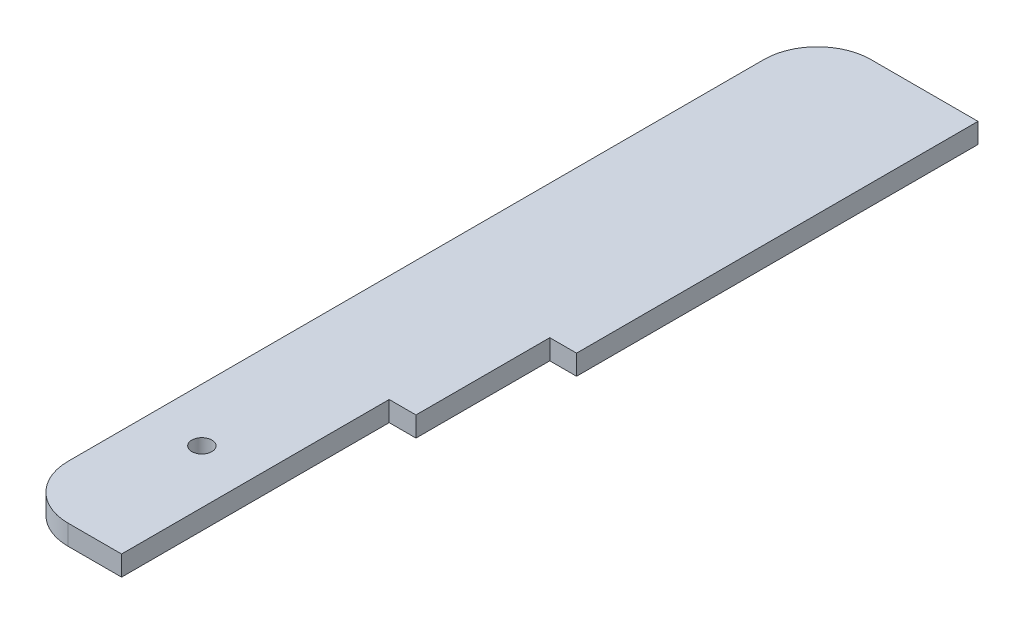
ISO-10303-21;
HEADER;
FILE_DESCRIPTION(('STEP AP214'),'2;1');
FILE_NAME('part.step','',(''),(''),'','','');
FILE_SCHEMA(('AUTOMOTIVE_DESIGN { 1 0 10303 214 1 1 1 1 }'));
ENDSEC;
DATA;
#1=APPLICATION_CONTEXT('core data for automotive mechanical design processes');
#2=APPLICATION_PROTOCOL_DEFINITION('international standard','automotive_design',2000,#1);
#3=PRODUCT_CONTEXT('',#1,'mechanical');
#4=PRODUCT('Part','Part','',(#3));
#5=PRODUCT_RELATED_PRODUCT_CATEGORY('part','',(#4));
#6=PRODUCT_DEFINITION_FORMATION('','',#4);
#7=PRODUCT_DEFINITION_CONTEXT('part definition',#1,'design');
#8=PRODUCT_DEFINITION('design','',#6,#7);
#9=PRODUCT_DEFINITION_SHAPE('','',#8);
#10=(LENGTH_UNIT() NAMED_UNIT(*) SI_UNIT(.MILLI.,.METRE.));
#11=(NAMED_UNIT(*) PLANE_ANGLE_UNIT() SI_UNIT($,.RADIAN.));
#12=(NAMED_UNIT(*) SI_UNIT($,.STERADIAN.) SOLID_ANGLE_UNIT());
#13=UNCERTAINTY_MEASURE_WITH_UNIT(LENGTH_MEASURE(1.E-05),#10,'distance_accuracy_value','');
#14=(GEOMETRIC_REPRESENTATION_CONTEXT(3) GLOBAL_UNCERTAINTY_ASSIGNED_CONTEXT((#13)) GLOBAL_UNIT_ASSIGNED_CONTEXT((#10,
#11,#12)) REPRESENTATION_CONTEXT('',''));
#15=CARTESIAN_POINT('',(0.,0.,0.));
#16=DIRECTION('',(0.,0.,1.));
#17=DIRECTION('',(1.,0.,0.));
#18=AXIS2_PLACEMENT_3D('',#15,#16,#17);
#19=CARTESIAN_POINT('',(0.,4.7625,0.));
#20=DIRECTION('',(-1.,0.,0.));
#21=DIRECTION('',(0.,0.,1.));
#22=AXIS2_PLACEMENT_3D('',#19,#20,#21);
#23=PLANE('',#22);
#24=DIRECTION('',(0.,0.,-1.));
#25=VECTOR('',#24,1.);
#26=CARTESIAN_POINT('',(0.,-4.7625,0.));
#27=LINE('',#26,#25);
#28=CARTESIAN_POINT('',(0.,-4.7625,0.));
#29=VERTEX_POINT('',#28);
#30=CARTESIAN_POINT('',(0.,-4.7625,-127.));
#31=VERTEX_POINT('',#30);
#32=EDGE_CURVE('E134',#29,#31,#27,.T.);
#33=ORIENTED_EDGE('',*,*,#32,.T.);
#34=DIRECTION('',(0.,-1.,0.));
#35=VECTOR('',#34,1.);
#36=CARTESIAN_POINT('',(0.,4.7625,-127.));
#37=LINE('',#36,#35);
#38=CARTESIAN_POINT('',(0.,4.7625,-127.));
#39=VERTEX_POINT('',#38);
#40=EDGE_CURVE('E117',#39,#31,#37,.T.);
#41=ORIENTED_EDGE('',*,*,#40,.F.);
#42=DIRECTION('',(0.,0.,-1.));
#43=VECTOR('',#42,1.);
#44=CARTESIAN_POINT('',(0.,4.7625,0.));
#45=LINE('',#44,#43);
#46=CARTESIAN_POINT('',(0.,4.7625,0.));
#47=VERTEX_POINT('',#46);
#48=EDGE_CURVE('E123',#47,#39,#45,.T.);
#49=ORIENTED_EDGE('',*,*,#48,.F.);
#50=DIRECTION('',(0.,-1.,0.));
#51=VECTOR('',#50,1.);
#52=CARTESIAN_POINT('',(0.,4.7625,0.));
#53=LINE('',#52,#51);
#54=EDGE_CURVE('E181',#47,#29,#53,.T.);
#55=ORIENTED_EDGE('',*,*,#54,.T.);
#56=EDGE_LOOP('',(#33,#41,#49,#55));
#57=FACE_BOUND('',#56,.T.);
#58=ADVANCED_FACE('F33',(#57),#23,.F.);
#59=CARTESIAN_POINT('',(0.,4.7625,-127.));
#60=DIRECTION('',(0.,0.,-1.));
#61=DIRECTION('',(-1.,0.,0.));
#62=AXIS2_PLACEMENT_3D('',#59,#60,#61);
#63=PLANE('',#62);
#64=DIRECTION('',(1.,0.,0.));
#65=VECTOR('',#64,1.);
#66=CARTESIAN_POINT('',(0.,-4.7625,-127.));
#67=LINE('',#66,#65);
#68=CARTESIAN_POINT('',(12.7,-4.7625,-127.));
#69=VERTEX_POINT('',#68);
#70=EDGE_CURVE('E197',#31,#69,#67,.T.);
#71=ORIENTED_EDGE('',*,*,#70,.T.);
#72=DIRECTION('',(0.,-1.,0.));
#73=VECTOR('',#72,1.);
#74=CARTESIAN_POINT('',(12.7,4.7625,-127.));
#75=LINE('',#74,#73);
#76=CARTESIAN_POINT('',(12.7,4.7625,-127.));
#77=VERTEX_POINT('',#76);
#78=EDGE_CURVE('E120',#77,#69,#75,.T.);
#79=ORIENTED_EDGE('',*,*,#78,.F.);
#80=DIRECTION('',(1.,0.,0.));
#81=VECTOR('',#80,1.);
#82=CARTESIAN_POINT('',(0.,4.7625,-127.));
#83=LINE('',#82,#81);
#84=EDGE_CURVE('E113',#39,#77,#83,.T.);
#85=ORIENTED_EDGE('',*,*,#84,.F.);
#86=ORIENTED_EDGE('',*,*,#40,.T.);
#87=EDGE_LOOP('',(#71,#79,#85,#86));
#88=FACE_BOUND('',#87,.T.);
#89=ADVANCED_FACE('F115',(#88),#63,.F.);
#90=CARTESIAN_POINT('',(12.7,4.7625,-127.));
#91=DIRECTION('',(-1.,0.,0.));
#92=DIRECTION('',(0.,0.,1.));
#93=AXIS2_PLACEMENT_3D('',#90,#91,#92);
#94=PLANE('',#93);
#95=DIRECTION('',(0.,0.,-1.));
#96=VECTOR('',#95,1.);
#97=CARTESIAN_POINT('',(12.7,-4.7625,-127.));
#98=LINE('',#97,#96);
#99=CARTESIAN_POINT('',(12.7,-4.7625,-190.5));
#100=VERTEX_POINT('',#99);
#101=EDGE_CURVE('E196',#69,#100,#98,.T.);
#102=ORIENTED_EDGE('',*,*,#101,.T.);
#103=DIRECTION('',(0.,-1.,0.));
#104=VECTOR('',#103,1.);
#105=CARTESIAN_POINT('',(12.7,4.7625,-190.5));
#106=LINE('',#105,#104);
#107=CARTESIAN_POINT('',(12.7,4.7625,-190.5));
#108=VERTEX_POINT('',#107);
#109=EDGE_CURVE('E139',#108,#100,#106,.T.);
#110=ORIENTED_EDGE('',*,*,#109,.F.);
#111=DIRECTION('',(0.,0.,-1.));
#112=VECTOR('',#111,1.);
#113=CARTESIAN_POINT('',(12.7,4.7625,-127.));
#114=LINE('',#113,#112);
#115=EDGE_CURVE('E122',#77,#108,#114,.T.);
#116=ORIENTED_EDGE('',*,*,#115,.F.);
#117=ORIENTED_EDGE('',*,*,#78,.T.);
#118=EDGE_LOOP('',(#102,#110,#116,#117));
#119=FACE_BOUND('',#118,.T.);
#120=ADVANCED_FACE('F235',(#119),#94,.F.);
#121=CARTESIAN_POINT('',(12.7,4.7625,-190.5));
#122=DIRECTION('',(0.,0.,-1.));
#123=DIRECTION('',(-1.,0.,0.));
#124=AXIS2_PLACEMENT_3D('',#121,#122,#123);
#125=PLANE('',#124);
#126=DIRECTION('',(1.,0.,0.));
#127=VECTOR('',#126,1.);
#128=CARTESIAN_POINT('',(12.7,-4.7625,-190.5));
#129=LINE('',#128,#127);
#130=CARTESIAN_POINT('',(25.4,-4.7625,-190.5));
#131=VERTEX_POINT('',#130);
#132=EDGE_CURVE('E176',#100,#131,#129,.T.);
#133=ORIENTED_EDGE('',*,*,#132,.T.);
#134=DIRECTION('',(0.,-1.,0.));
#135=VECTOR('',#134,1.);
#136=CARTESIAN_POINT('',(25.4,4.7625,-190.5));
#137=LINE('',#136,#135);
#138=CARTESIAN_POINT('',(25.4,4.7625,-190.5));
#139=VERTEX_POINT('',#138);
#140=EDGE_CURVE('E184',#139,#131,#137,.T.);
#141=ORIENTED_EDGE('',*,*,#140,.F.);
#142=DIRECTION('',(1.,0.,0.));
#143=VECTOR('',#142,1.);
#144=CARTESIAN_POINT('',(12.7,4.7625,-190.5));
#145=LINE('',#144,#143);
#146=EDGE_CURVE('E193',#108,#139,#145,.T.);
#147=ORIENTED_EDGE('',*,*,#146,.F.);
#148=ORIENTED_EDGE('',*,*,#109,.T.);
#149=EDGE_LOOP('',(#133,#141,#147,#148));
#150=FACE_BOUND('',#149,.T.);
#151=ADVANCED_FACE('F191',(#150),#125,.F.);
#152=CARTESIAN_POINT('',(25.4,4.7625,-190.5));
#153=DIRECTION('',(-1.,0.,0.));
#154=DIRECTION('',(0.,0.,1.));
#155=AXIS2_PLACEMENT_3D('',#152,#153,#154);
#156=PLANE('',#155);
#157=DIRECTION('',(0.,0.,-1.));
#158=VECTOR('',#157,1.);
#159=CARTESIAN_POINT('',(25.4,-4.7625,-190.5));
#160=LINE('',#159,#158);
#161=CARTESIAN_POINT('',(25.4,-4.7625,-381.));
#162=VERTEX_POINT('',#161);
#163=EDGE_CURVE('E173',#131,#162,#160,.T.);
#164=ORIENTED_EDGE('',*,*,#163,.T.);
#165=DIRECTION('',(0.,-1.,0.));
#166=VECTOR('',#165,1.);
#167=CARTESIAN_POINT('',(25.4,4.7625,-381.));
#168=LINE('',#167,#166);
#169=CARTESIAN_POINT('',(25.4,4.7625,-381.));
#170=VERTEX_POINT('',#169);
#171=EDGE_CURVE('E172',#170,#162,#168,.T.);
#172=ORIENTED_EDGE('',*,*,#171,.F.);
#173=DIRECTION('',(0.,0.,-1.));
#174=VECTOR('',#173,1.);
#175=CARTESIAN_POINT('',(25.4,4.7625,-190.5));
#176=LINE('',#175,#174);
#177=EDGE_CURVE('E205',#139,#170,#176,.T.);
#178=ORIENTED_EDGE('',*,*,#177,.F.);
#179=ORIENTED_EDGE('',*,*,#140,.T.);
#180=EDGE_LOOP('',(#164,#172,#178,#179));
#181=FACE_BOUND('',#180,.T.);
#182=ADVANCED_FACE('F251',(#181),#156,.F.);
#183=CARTESIAN_POINT('',(25.4,4.7625,-381.));
#184=DIRECTION('',(0.,0.,1.));
#185=DIRECTION('',(1.,0.,0.));
#186=AXIS2_PLACEMENT_3D('',#183,#184,#185);
#187=PLANE('',#186);
#188=DIRECTION('',(-1.,0.,0.));
#189=VECTOR('',#188,1.);
#190=CARTESIAN_POINT('',(25.4,-4.7625,-381.));
#191=LINE('',#190,#189);
#192=CARTESIAN_POINT('',(-25.4000000000001,-4.7625,-381.));
#193=VERTEX_POINT('',#192);
#194=EDGE_CURVE('E167',#162,#193,#191,.T.);
#195=ORIENTED_EDGE('',*,*,#194,.T.);
#196=DIRECTION('',(0.,-1.,0.));
#197=VECTOR('',#196,1.);
#198=CARTESIAN_POINT('',(-25.4000000000001,4.7625,-381.));
#199=LINE('',#198,#197);
#200=CARTESIAN_POINT('',(-25.4000000000001,4.7625,-381.));
#201=VERTEX_POINT('',#200);
#202=EDGE_CURVE('E56',#193,#201,#199,.F.);
#203=ORIENTED_EDGE('',*,*,#202,.T.);
#204=DIRECTION('',(-1.,0.,0.));
#205=VECTOR('',#204,1.);
#206=CARTESIAN_POINT('',(25.4,4.7625,-381.));
#207=LINE('',#206,#205);
#208=EDGE_CURVE('E153',#170,#201,#207,.T.);
#209=ORIENTED_EDGE('',*,*,#208,.F.);
#210=ORIENTED_EDGE('',*,*,#171,.T.);
#211=EDGE_LOOP('',(#195,#203,#209,#210));
#212=FACE_BOUND('',#211,.T.);
#213=ADVANCED_FACE('F170',(#212),#187,.F.);
#214=CARTESIAN_POINT('',(-50.8000000000001,4.7625,-381.));
#215=DIRECTION('',(1.,0.,0.));
#216=DIRECTION('',(0.,0.,-1.));
#217=AXIS2_PLACEMENT_3D('',#214,#215,#216);
#218=PLANE('',#217);
#219=DIRECTION('',(0.,0.,1.));
#220=VECTOR('',#219,1.);
#221=CARTESIAN_POINT('',(-50.8000000000001,4.7625,-381.));
#222=LINE('',#221,#220);
#223=CARTESIAN_POINT('',(-50.8,4.7625,-355.6));
#224=VERTEX_POINT('',#223);
#225=CARTESIAN_POINT('',(-50.8,4.7625,-25.4));
#226=VERTEX_POINT('',#225);
#227=EDGE_CURVE('E152',#224,#226,#222,.T.);
#228=ORIENTED_EDGE('',*,*,#227,.F.);
#229=DIRECTION('',(0.,-1.,0.));
#230=VECTOR('',#229,1.);
#231=CARTESIAN_POINT('',(-50.8,4.7625,-355.6));
#232=LINE('',#231,#230);
#233=CARTESIAN_POINT('',(-50.8,-4.7625,-355.6));
#234=VERTEX_POINT('',#233);
#235=EDGE_CURVE('E137',#224,#234,#232,.T.);
#236=ORIENTED_EDGE('',*,*,#235,.T.);
#237=DIRECTION('',(0.,0.,1.));
#238=VECTOR('',#237,1.);
#239=CARTESIAN_POINT('',(-50.8000000000001,-4.7625,-381.));
#240=LINE('',#239,#238);
#241=CARTESIAN_POINT('',(-50.8,-4.7625,-25.4));
#242=VERTEX_POINT('',#241);
#243=EDGE_CURVE('E168',#234,#242,#240,.T.);
#244=ORIENTED_EDGE('',*,*,#243,.T.);
#245=DIRECTION('',(0.,-1.,0.));
#246=VECTOR('',#245,1.);
#247=CARTESIAN_POINT('',(-50.8,4.7625,-25.4));
#248=LINE('',#247,#246);
#249=EDGE_CURVE('E135',#242,#226,#248,.F.);
#250=ORIENTED_EDGE('',*,*,#249,.T.);
#251=EDGE_LOOP('',(#228,#236,#244,#250));
#252=FACE_BOUND('',#251,.T.);
#253=ADVANCED_FACE('F157',(#252),#218,.F.);
#254=CARTESIAN_POINT('',(0.,4.7625,0.));
#255=DIRECTION('',(0.,0.,-1.));
#256=DIRECTION('',(-1.,0.,0.));
#257=AXIS2_PLACEMENT_3D('',#254,#255,#256);
#258=PLANE('',#257);
#259=DIRECTION('',(1.,0.,0.));
#260=VECTOR('',#259,1.);
#261=CARTESIAN_POINT('',(0.,4.7625,0.));
#262=LINE('',#261,#260);
#263=CARTESIAN_POINT('',(-25.4,4.7625,0.));
#264=VERTEX_POINT('',#263);
#265=EDGE_CURVE('E127',#264,#47,#262,.T.);
#266=ORIENTED_EDGE('',*,*,#265,.F.);
#267=DIRECTION('',(0.,-1.,0.));
#268=VECTOR('',#267,1.);
#269=CARTESIAN_POINT('',(-25.4,4.7625,0.));
#270=LINE('',#269,#268);
#271=CARTESIAN_POINT('',(-25.4,-4.7625,0.));
#272=VERTEX_POINT('',#271);
#273=EDGE_CURVE('E11',#264,#272,#270,.T.);
#274=ORIENTED_EDGE('',*,*,#273,.T.);
#275=DIRECTION('',(1.,0.,0.));
#276=VECTOR('',#275,1.);
#277=CARTESIAN_POINT('',(0.,-4.7625,0.));
#278=LINE('',#277,#276);
#279=EDGE_CURVE('E131',#272,#29,#278,.T.);
#280=ORIENTED_EDGE('',*,*,#279,.T.);
#281=ORIENTED_EDGE('',*,*,#54,.F.);
#282=EDGE_LOOP('',(#266,#274,#280,#281));
#283=FACE_BOUND('',#282,.T.);
#284=ADVANCED_FACE('F218',(#283),#258,.F.);
#285=CARTESIAN_POINT('',(0.,4.7625,0.));
#286=DIRECTION('',(0.,-1.,0.));
#287=DIRECTION('',(0.,0.,-1.));
#288=AXIS2_PLACEMENT_3D('',#285,#286,#287);
#289=PLANE('',#288);
#290=CARTESIAN_POINT('',(-25.4,4.7625,-63.5));
#291=DIRECTION('',(0.,1.,0.));
#292=DIRECTION('',(0.,0.,1.));
#293=AXIS2_PLACEMENT_3D('',#290,#291,#292);
#294=CIRCLE('',#293,4.76249999999999);
#295=CARTESIAN_POINT('',(-25.4,4.7625,-58.7375));
#296=VERTEX_POINT('',#295);
#297=EDGE_CURVE('E211',#296,#296,#294,.T.);
#298=ORIENTED_EDGE('',*,*,#297,.F.);
#299=EDGE_LOOP('',(#298));
#300=FACE_BOUND('',#299,.T.);
#301=ORIENTED_EDGE('',*,*,#208,.T.);
#302=CARTESIAN_POINT('',(-25.4000000000001,4.7625,-355.6));
#303=DIRECTION('',(0.,-1.,0.));
#304=DIRECTION('',(0.,0.,-1.));
#305=AXIS2_PLACEMENT_3D('',#302,#303,#304);
#306=CIRCLE('',#305,25.4);
#307=EDGE_CURVE('E41',#201,#224,#306,.F.);
#308=ORIENTED_EDGE('',*,*,#307,.T.);
#309=ORIENTED_EDGE('',*,*,#227,.T.);
#310=CARTESIAN_POINT('',(-25.4,4.7625,-25.4));
#311=DIRECTION('',(0.,-1.,0.));
#312=DIRECTION('',(0.,0.,-1.));
#313=AXIS2_PLACEMENT_3D('',#310,#311,#312);
#314=CIRCLE('',#313,25.4);
#315=EDGE_CURVE('E48',#226,#264,#314,.F.);
#316=ORIENTED_EDGE('',*,*,#315,.T.);
#317=ORIENTED_EDGE('',*,*,#265,.T.);
#318=ORIENTED_EDGE('',*,*,#48,.T.);
#319=ORIENTED_EDGE('',*,*,#84,.T.);
#320=ORIENTED_EDGE('',*,*,#115,.T.);
#321=ORIENTED_EDGE('',*,*,#146,.T.);
#322=ORIENTED_EDGE('',*,*,#177,.T.);
#323=EDGE_LOOP('',(#301,#308,#309,#316,#317,#318,#319,#320,#321,#322));
#324=FACE_BOUND('',#323,.T.);
#325=ADVANCED_FACE('F126',(#300,#324),#289,.F.);
#326=CARTESIAN_POINT('',(0.,-4.7625,0.));
#327=DIRECTION('',(0.,-1.,0.));
#328=DIRECTION('',(0.,0.,-1.));
#329=AXIS2_PLACEMENT_3D('',#326,#327,#328);
#330=PLANE('',#329);
#331=CARTESIAN_POINT('',(-25.4,-4.7625,-63.5));
#332=DIRECTION('',(0.,-1.,0.));
#333=DIRECTION('',(0.,0.,-1.));
#334=AXIS2_PLACEMENT_3D('',#331,#332,#333);
#335=CIRCLE('',#334,4.76249999999999);
#336=CARTESIAN_POINT('',(-25.4,-4.7625,-68.2625));
#337=VERTEX_POINT('',#336);
#338=EDGE_CURVE('E202',#337,#337,#335,.T.);
#339=ORIENTED_EDGE('',*,*,#338,.F.);
#340=EDGE_LOOP('',(#339));
#341=FACE_BOUND('',#340,.T.);
#342=ORIENTED_EDGE('',*,*,#243,.F.);
#343=CARTESIAN_POINT('',(-25.4000000000001,-4.7625,-355.6));
#344=DIRECTION('',(0.,-1.,0.));
#345=DIRECTION('',(0.,0.,-1.));
#346=AXIS2_PLACEMENT_3D('',#343,#344,#345);
#347=CIRCLE('',#346,25.4);
#348=EDGE_CURVE('E147',#234,#193,#347,.T.);
#349=ORIENTED_EDGE('',*,*,#348,.T.);
#350=ORIENTED_EDGE('',*,*,#194,.F.);
#351=ORIENTED_EDGE('',*,*,#163,.F.);
#352=ORIENTED_EDGE('',*,*,#132,.F.);
#353=ORIENTED_EDGE('',*,*,#101,.F.);
#354=ORIENTED_EDGE('',*,*,#70,.F.);
#355=ORIENTED_EDGE('',*,*,#32,.F.);
#356=ORIENTED_EDGE('',*,*,#279,.F.);
#357=CARTESIAN_POINT('',(-25.4,-4.7625,-25.4));
#358=DIRECTION('',(0.,-1.,0.));
#359=DIRECTION('',(0.,0.,-1.));
#360=AXIS2_PLACEMENT_3D('',#357,#358,#359);
#361=CIRCLE('',#360,25.4);
#362=EDGE_CURVE('E145',#272,#242,#361,.T.);
#363=ORIENTED_EDGE('',*,*,#362,.T.);
#364=EDGE_LOOP('',(#342,#349,#350,#351,#352,#353,#354,#355,#356,#363));
#365=FACE_BOUND('',#364,.T.);
#366=ADVANCED_FACE('F165',(#341,#365),#330,.T.);
#367=CARTESIAN_POINT('',(-25.4000000000001,4.7625,-355.6));
#368=DIRECTION('',(0.,-1.,0.));
#369=DIRECTION('',(0.,0.,-1.));
#370=AXIS2_PLACEMENT_3D('',#367,#368,#369);
#371=CYLINDRICAL_SURFACE('',#370,25.4);
#372=ORIENTED_EDGE('',*,*,#307,.F.);
#373=ORIENTED_EDGE('',*,*,#202,.F.);
#374=ORIENTED_EDGE('',*,*,#348,.F.);
#375=ORIENTED_EDGE('',*,*,#235,.F.);
#376=EDGE_LOOP('',(#372,#373,#374,#375));
#377=FACE_BOUND('',#376,.T.);
#378=ADVANCED_FACE('F162',(#377),#371,.T.);
#379=CARTESIAN_POINT('',(-25.4,4.7625,-25.4));
#380=DIRECTION('',(0.,-1.,0.));
#381=DIRECTION('',(0.,0.,-1.));
#382=AXIS2_PLACEMENT_3D('',#379,#380,#381);
#383=CYLINDRICAL_SURFACE('',#382,25.4);
#384=ORIENTED_EDGE('',*,*,#315,.F.);
#385=ORIENTED_EDGE('',*,*,#249,.F.);
#386=ORIENTED_EDGE('',*,*,#362,.F.);
#387=ORIENTED_EDGE('',*,*,#273,.F.);
#388=EDGE_LOOP('',(#384,#385,#386,#387));
#389=FACE_BOUND('',#388,.T.);
#390=ADVANCED_FACE('F35',(#389),#383,.T.);
#391=CARTESIAN_POINT('',(-25.4,4.7625,-63.5));
#392=DIRECTION('',(0.,1.,0.));
#393=DIRECTION('',(0.,0.,1.));
#394=AXIS2_PLACEMENT_3D('',#391,#392,#393);
#395=CYLINDRICAL_SURFACE('',#394,4.76249999999999);
#396=ORIENTED_EDGE('',*,*,#338,.T.);
#397=EDGE_LOOP('',(#396));
#398=FACE_BOUND('',#397,.T.);
#399=ORIENTED_EDGE('',*,*,#297,.T.);
#400=EDGE_LOOP('',(#399));
#401=FACE_BOUND('',#400,.T.);
#402=ADVANCED_FACE('F215',(#398,#401),#395,.F.);
#403=CLOSED_SHELL('',(#58,#89,#120,#151,#182,#213,#253,#284,#325,#366,#378,#390,#402));
#404=MANIFOLD_SOLID_BREP('B2',#403);
#405=ADVANCED_BREP_SHAPE_REPRESENTATION('',(#18,#404),#14);
#406=SHAPE_DEFINITION_REPRESENTATION(#9,#405);
ENDSEC;
END-ISO-10303-21;
